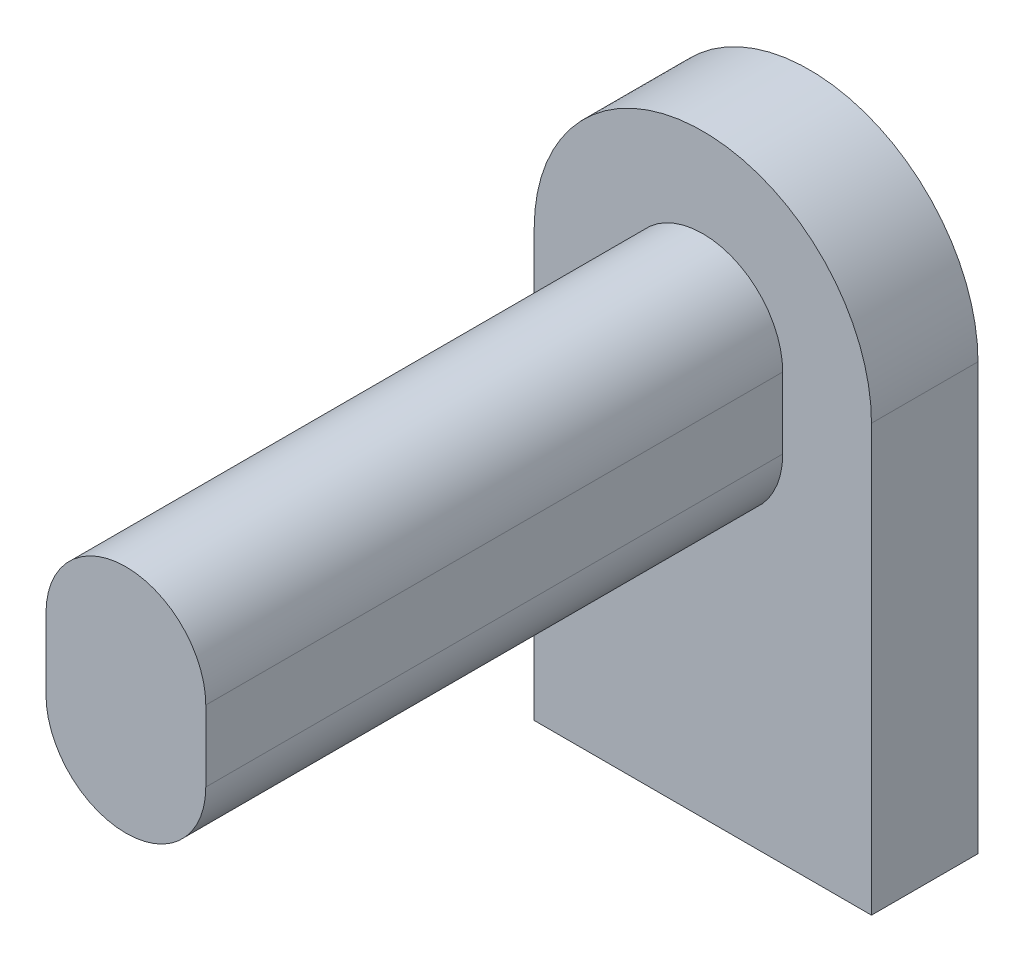
ISO-10303-21;
HEADER;
FILE_DESCRIPTION(('STEP AP214'),'2;1');
FILE_NAME('part.step','',(''),(''),'','','');
FILE_SCHEMA(('AUTOMOTIVE_DESIGN { 1 0 10303 214 1 1 1 1 }'));
ENDSEC;
DATA;
#1=APPLICATION_CONTEXT('core data for automotive mechanical design processes');
#2=APPLICATION_PROTOCOL_DEFINITION('international standard','automotive_design',2000,#1);
#3=PRODUCT_CONTEXT('',#1,'mechanical');
#4=PRODUCT('Part','Part','',(#3));
#5=PRODUCT_RELATED_PRODUCT_CATEGORY('part','',(#4));
#6=PRODUCT_DEFINITION_FORMATION('','',#4);
#7=PRODUCT_DEFINITION_CONTEXT('part definition',#1,'design');
#8=PRODUCT_DEFINITION('design','',#6,#7);
#9=PRODUCT_DEFINITION_SHAPE('','',#8);
#10=(LENGTH_UNIT() NAMED_UNIT(*) SI_UNIT(.MILLI.,.METRE.));
#11=(NAMED_UNIT(*) PLANE_ANGLE_UNIT() SI_UNIT($,.RADIAN.));
#12=(NAMED_UNIT(*) SI_UNIT($,.STERADIAN.) SOLID_ANGLE_UNIT());
#13=UNCERTAINTY_MEASURE_WITH_UNIT(LENGTH_MEASURE(1.E-05),#10,'distance_accuracy_value','');
#14=(GEOMETRIC_REPRESENTATION_CONTEXT(3) GLOBAL_UNCERTAINTY_ASSIGNED_CONTEXT((#13)) GLOBAL_UNIT_ASSIGNED_CONTEXT((#10,
#11,#12)) REPRESENTATION_CONTEXT('',''));
#15=CARTESIAN_POINT('',(0.,0.,0.));
#16=DIRECTION('',(0.,0.,1.));
#17=DIRECTION('',(1.,0.,0.));
#18=AXIS2_PLACEMENT_3D('',#15,#16,#17);
#19=CARTESIAN_POINT('',(-53.8351531475329,20.8584262703084,6.5));
#20=DIRECTION('',(0.,0.,-1.));
#21=DIRECTION('',(-1.,0.,0.));
#22=AXIS2_PLACEMENT_3D('',#19,#20,#21);
#23=CYLINDRICAL_SURFACE('',#22,0.900000000000001);
#24=CARTESIAN_POINT('',(-53.8351531475329,20.8584262703084,0.));
#25=DIRECTION('',(0.,0.,1.));
#26=DIRECTION('',(-1.,0.,0.));
#27=AXIS2_PLACEMENT_3D('',#24,#25,#26);
#28=CIRCLE('',#27,0.900000000000001);
#29=CARTESIAN_POINT('',(-52.9351531475329,20.8584262703084,0.));
#30=VERTEX_POINT('',#29);
#31=CARTESIAN_POINT('',(-54.7351531475329,20.8584262703084,0.));
#32=VERTEX_POINT('',#31);
#33=EDGE_CURVE('E103',#30,#32,#28,.T.);
#34=ORIENTED_EDGE('',*,*,#33,.T.);
#35=DIRECTION('',(0.,0.,-1.));
#36=VECTOR('',#35,1.);
#37=CARTESIAN_POINT('',(-54.7351531475329,20.8584262703084,6.5));
#38=LINE('',#37,#36);
#39=CARTESIAN_POINT('',(-54.7351531475329,20.8584262703084,6.5));
#40=VERTEX_POINT('',#39);
#41=EDGE_CURVE('E11',#40,#32,#38,.T.);
#42=ORIENTED_EDGE('',*,*,#41,.F.);
#43=CARTESIAN_POINT('',(-53.8351531475329,20.8584262703084,6.5));
#44=DIRECTION('',(0.,0.,1.));
#45=DIRECTION('',(-1.,0.,0.));
#46=AXIS2_PLACEMENT_3D('',#43,#44,#45);
#47=CIRCLE('',#46,0.900000000000001);
#48=CARTESIAN_POINT('',(-52.9351531475329,20.8584262703084,6.5));
#49=VERTEX_POINT('',#48);
#50=EDGE_CURVE('E135',#49,#40,#47,.T.);
#51=ORIENTED_EDGE('',*,*,#50,.F.);
#52=DIRECTION('',(0.,0.,-1.));
#53=VECTOR('',#52,1.);
#54=CARTESIAN_POINT('',(-52.9351531475329,20.8584262703084,6.5));
#55=LINE('',#54,#53);
#56=EDGE_CURVE('E143',#49,#30,#55,.T.);
#57=ORIENTED_EDGE('',*,*,#56,.T.);
#58=EDGE_LOOP('',(#34,#42,#51,#57));
#59=FACE_BOUND('',#58,.T.);
#60=ADVANCED_FACE('F33',(#59),#23,.T.);
#61=CARTESIAN_POINT('',(-54.7351531475329,20.8584262703084,6.5));
#62=DIRECTION('',(1.,0.,0.));
#63=DIRECTION('',(0.,0.,-1.));
#64=AXIS2_PLACEMENT_3D('',#61,#62,#63);
#65=PLANE('',#64);
#66=DIRECTION('',(0.,-1.,0.));
#67=VECTOR('',#66,1.);
#68=CARTESIAN_POINT('',(-54.7351531475329,20.8584262703084,0.));
#69=LINE('',#68,#67);
#70=CARTESIAN_POINT('',(-54.7351531475329,20.0584262703084,0.));
#71=VERTEX_POINT('',#70);
#72=EDGE_CURVE('E146',#32,#71,#69,.T.);
#73=ORIENTED_EDGE('',*,*,#72,.T.);
#74=DIRECTION('',(0.,0.,-1.));
#75=VECTOR('',#74,1.);
#76=CARTESIAN_POINT('',(-54.7351531475329,20.0584262703084,6.5));
#77=LINE('',#76,#75);
#78=CARTESIAN_POINT('',(-54.7351531475329,20.0584262703084,6.5));
#79=VERTEX_POINT('',#78);
#80=EDGE_CURVE('E41',#79,#71,#77,.T.);
#81=ORIENTED_EDGE('',*,*,#80,.F.);
#82=DIRECTION('',(0.,-1.,0.));
#83=VECTOR('',#82,1.);
#84=CARTESIAN_POINT('',(-54.7351531475329,20.8584262703084,6.5));
#85=LINE('',#84,#83);
#86=EDGE_CURVE('E137',#40,#79,#85,.T.);
#87=ORIENTED_EDGE('',*,*,#86,.F.);
#88=ORIENTED_EDGE('',*,*,#41,.T.);
#89=EDGE_LOOP('',(#73,#81,#87,#88));
#90=FACE_BOUND('',#89,.T.);
#91=ADVANCED_FACE('F166',(#90),#65,.F.);
#92=CARTESIAN_POINT('',(-53.8351531475329,20.0584262703084,6.5));
#93=DIRECTION('',(0.,0.,-1.));
#94=DIRECTION('',(-1.,0.,0.));
#95=AXIS2_PLACEMENT_3D('',#92,#93,#94);
#96=CYLINDRICAL_SURFACE('',#95,0.900000000000001);
#97=CARTESIAN_POINT('',(-53.8351531475329,20.0584262703084,0.));
#98=DIRECTION('',(0.,0.,1.));
#99=DIRECTION('',(-1.,0.,0.));
#100=AXIS2_PLACEMENT_3D('',#97,#98,#99);
#101=CIRCLE('',#100,0.900000000000001);
#102=CARTESIAN_POINT('',(-52.9351531475329,20.0584262703084,0.));
#103=VERTEX_POINT('',#102);
#104=EDGE_CURVE('E149',#71,#103,#101,.T.);
#105=ORIENTED_EDGE('',*,*,#104,.T.);
#106=DIRECTION('',(0.,0.,-1.));
#107=VECTOR('',#106,1.);
#108=CARTESIAN_POINT('',(-52.9351531475329,20.0584262703084,6.5));
#109=LINE('',#108,#107);
#110=CARTESIAN_POINT('',(-52.9351531475329,20.0584262703084,6.5));
#111=VERTEX_POINT('',#110);
#112=EDGE_CURVE('E156',#111,#103,#109,.T.);
#113=ORIENTED_EDGE('',*,*,#112,.F.);
#114=CARTESIAN_POINT('',(-53.8351531475329,20.0584262703084,6.5));
#115=DIRECTION('',(0.,0.,1.));
#116=DIRECTION('',(-1.,0.,0.));
#117=AXIS2_PLACEMENT_3D('',#114,#115,#116);
#118=CIRCLE('',#117,0.900000000000001);
#119=EDGE_CURVE('E140',#79,#111,#118,.T.);
#120=ORIENTED_EDGE('',*,*,#119,.F.);
#121=ORIENTED_EDGE('',*,*,#80,.T.);
#122=EDGE_LOOP('',(#105,#113,#120,#121));
#123=FACE_BOUND('',#122,.T.);
#124=ADVANCED_FACE('F162',(#123),#96,.T.);
#125=CARTESIAN_POINT('',(-52.9351531475329,20.8584262703084,6.5));
#126=DIRECTION('',(-1.,0.,0.));
#127=DIRECTION('',(0.,0.,1.));
#128=AXIS2_PLACEMENT_3D('',#125,#126,#127);
#129=PLANE('',#128);
#130=DIRECTION('',(0.,1.,0.));
#131=VECTOR('',#130,1.);
#132=CARTESIAN_POINT('',(-52.9351531475329,20.8584262703084,0.));
#133=LINE('',#132,#131);
#134=EDGE_CURVE('E138',#103,#30,#133,.T.);
#135=ORIENTED_EDGE('',*,*,#134,.T.);
#136=ORIENTED_EDGE('',*,*,#56,.F.);
#137=DIRECTION('',(0.,1.,0.));
#138=VECTOR('',#137,1.);
#139=CARTESIAN_POINT('',(-52.9351531475329,20.8584262703084,6.5));
#140=LINE('',#139,#138);
#141=EDGE_CURVE('E48',#111,#49,#140,.T.);
#142=ORIENTED_EDGE('',*,*,#141,.F.);
#143=ORIENTED_EDGE('',*,*,#112,.T.);
#144=EDGE_LOOP('',(#135,#136,#142,#143));
#145=FACE_BOUND('',#144,.T.);
#146=ADVANCED_FACE('F172',(#145),#129,.F.);
#147=CARTESIAN_POINT('',(-53.8351531475329,20.8584262703084,6.5));
#148=DIRECTION('',(0.,0.,-1.));
#149=DIRECTION('',(-1.,0.,0.));
#150=AXIS2_PLACEMENT_3D('',#147,#148,#149);
#151=PLANE('',#150);
#152=ORIENTED_EDGE('',*,*,#50,.T.);
#153=ORIENTED_EDGE('',*,*,#86,.T.);
#154=ORIENTED_EDGE('',*,*,#119,.T.);
#155=ORIENTED_EDGE('',*,*,#141,.T.);
#156=EDGE_LOOP('',(#152,#153,#154,#155));
#157=FACE_BOUND('',#156,.T.);
#158=ADVANCED_FACE('F175',(#157),#151,.F.);
#159=CARTESIAN_POINT('',(-55.7351531475329,1.61141797670313E-13,-1.2));
#160=DIRECTION('',(-1.,0.,0.));
#161=DIRECTION('',(0.,-1.,0.));
#162=AXIS2_PLACEMENT_3D('',#159,#160,#161);
#163=PLANE('',#162);
#164=DIRECTION('',(0.,-1.,0.));
#165=VECTOR('',#164,1.);
#166=CARTESIAN_POINT('',(-55.7351531475329,1.61141797670313E-13,0.));
#167=LINE('',#166,#165);
#168=CARTESIAN_POINT('',(-55.7351531475329,20.8584262703084,0.));
#169=VERTEX_POINT('',#168);
#170=CARTESIAN_POINT('',(-55.7351531475329,16.0584262703084,0.));
#171=VERTEX_POINT('',#170);
#172=EDGE_CURVE('E98',#169,#171,#167,.T.);
#173=ORIENTED_EDGE('',*,*,#172,.F.);
#174=DIRECTION('',(0.,0.,1.));
#175=VECTOR('',#174,1.);
#176=CARTESIAN_POINT('',(-55.7351531475329,20.8584262703084,-1.2));
#177=LINE('',#176,#175);
#178=CARTESIAN_POINT('',(-55.7351531475329,20.8584262703084,-1.2));
#179=VERTEX_POINT('',#178);
#180=EDGE_CURVE('E93',#179,#169,#177,.T.);
#181=ORIENTED_EDGE('',*,*,#180,.F.);
#182=DIRECTION('',(0.,-1.,0.));
#183=VECTOR('',#182,1.);
#184=CARTESIAN_POINT('',(-55.7351531475329,1.61141797670313E-13,-1.2));
#185=LINE('',#184,#183);
#186=CARTESIAN_POINT('',(-55.7351531475329,16.0584262703084,-1.2));
#187=VERTEX_POINT('',#186);
#188=EDGE_CURVE('E96',#179,#187,#185,.T.);
#189=ORIENTED_EDGE('',*,*,#188,.T.);
#190=DIRECTION('',(0.,0.,1.));
#191=VECTOR('',#190,1.);
#192=CARTESIAN_POINT('',(-55.7351531475329,16.0584262703084,-1.2));
#193=LINE('',#192,#191);
#194=EDGE_CURVE('E122',#187,#171,#193,.T.);
#195=ORIENTED_EDGE('',*,*,#194,.T.);
#196=EDGE_LOOP('',(#173,#181,#189,#195));
#197=FACE_BOUND('',#196,.T.);
#198=ADVANCED_FACE('F95',(#197),#163,.T.);
#199=CARTESIAN_POINT('',(-53.8351531475329,20.8584262703084,-1.2));
#200=DIRECTION('',(0.,0.,1.));
#201=DIRECTION('',(1.,0.,0.));
#202=AXIS2_PLACEMENT_3D('',#199,#200,#201);
#203=CYLINDRICAL_SURFACE('',#202,1.9);
#204=CARTESIAN_POINT('',(-53.8351531475329,20.8584262703084,0.));
#205=DIRECTION('',(0.,0.,-1.));
#206=DIRECTION('',(-1.,0.,0.));
#207=AXIS2_PLACEMENT_3D('',#204,#205,#206);
#208=CIRCLE('',#207,1.9);
#209=CARTESIAN_POINT('',(-51.9351531475329,20.8584262703084,0.));
#210=VERTEX_POINT('',#209);
#211=EDGE_CURVE('E124',#210,#169,#208,.F.);
#212=ORIENTED_EDGE('',*,*,#211,.F.);
#213=DIRECTION('',(0.,0.,1.));
#214=VECTOR('',#213,1.);
#215=CARTESIAN_POINT('',(-51.9351531475329,20.8584262703084,-1.2));
#216=LINE('',#215,#214);
#217=CARTESIAN_POINT('',(-51.9351531475329,20.8584262703084,-1.2));
#218=VERTEX_POINT('',#217);
#219=EDGE_CURVE('E104',#218,#210,#216,.T.);
#220=ORIENTED_EDGE('',*,*,#219,.F.);
#221=CARTESIAN_POINT('',(-53.8351531475329,20.8584262703084,-1.2));
#222=DIRECTION('',(0.,0.,-1.));
#223=DIRECTION('',(-1.,0.,0.));
#224=AXIS2_PLACEMENT_3D('',#221,#222,#223);
#225=CIRCLE('',#224,1.9);
#226=EDGE_CURVE('E109',#218,#179,#225,.F.);
#227=ORIENTED_EDGE('',*,*,#226,.T.);
#228=ORIENTED_EDGE('',*,*,#180,.T.);
#229=EDGE_LOOP('',(#212,#220,#227,#228));
#230=FACE_BOUND('',#229,.T.);
#231=ADVANCED_FACE('F115',(#230),#203,.T.);
#232=CARTESIAN_POINT('',(-51.9351531475329,1.50155215655794E-13,-1.2));
#233=DIRECTION('',(-1.,0.,0.));
#234=DIRECTION('',(0.,-1.,0.));
#235=AXIS2_PLACEMENT_3D('',#232,#233,#234);
#236=PLANE('',#235);
#237=DIRECTION('',(0.,-1.,0.));
#238=VECTOR('',#237,1.);
#239=CARTESIAN_POINT('',(-51.9351531475329,1.50155215655794E-13,0.));
#240=LINE('',#239,#238);
#241=CARTESIAN_POINT('',(-51.9351531475329,16.0584262703084,0.));
#242=VERTEX_POINT('',#241);
#243=EDGE_CURVE('E126',#210,#242,#240,.T.);
#244=ORIENTED_EDGE('',*,*,#243,.T.);
#245=DIRECTION('',(0.,0.,1.));
#246=VECTOR('',#245,1.);
#247=CARTESIAN_POINT('',(-51.9351531475329,16.0584262703084,-1.2));
#248=LINE('',#247,#246);
#249=CARTESIAN_POINT('',(-51.9351531475329,16.0584262703084,-1.2));
#250=VERTEX_POINT('',#249);
#251=EDGE_CURVE('E131',#250,#242,#248,.T.);
#252=ORIENTED_EDGE('',*,*,#251,.F.);
#253=DIRECTION('',(0.,-1.,0.));
#254=VECTOR('',#253,1.);
#255=CARTESIAN_POINT('',(-51.9351531475329,1.50155215655794E-13,-1.2));
#256=LINE('',#255,#254);
#257=EDGE_CURVE('E117',#218,#250,#256,.T.);
#258=ORIENTED_EDGE('',*,*,#257,.F.);
#259=ORIENTED_EDGE('',*,*,#219,.T.);
#260=EDGE_LOOP('',(#244,#252,#258,#259));
#261=FACE_BOUND('',#260,.T.);
#262=ADVANCED_FACE('F214',(#261),#236,.F.);
#263=CARTESIAN_POINT('',(0.,16.0584262703084,-1.2));
#264=DIRECTION('',(0.,1.,0.));
#265=DIRECTION('',(0.,0.,1.));
#266=AXIS2_PLACEMENT_3D('',#263,#264,#265);
#267=PLANE('',#266);
#268=DIRECTION('',(-1.,0.,0.));
#269=VECTOR('',#268,1.);
#270=CARTESIAN_POINT('',(0.,16.0584262703084,0.));
#271=LINE('',#270,#269);
#272=EDGE_CURVE('E113',#242,#171,#271,.T.);
#273=ORIENTED_EDGE('',*,*,#272,.T.);
#274=ORIENTED_EDGE('',*,*,#194,.F.);
#275=DIRECTION('',(-1.,0.,0.));
#276=VECTOR('',#275,1.);
#277=CARTESIAN_POINT('',(0.,16.0584262703084,-1.2));
#278=LINE('',#277,#276);
#279=EDGE_CURVE('E111',#250,#187,#278,.T.);
#280=ORIENTED_EDGE('',*,*,#279,.F.);
#281=ORIENTED_EDGE('',*,*,#251,.T.);
#282=EDGE_LOOP('',(#273,#274,#280,#281));
#283=FACE_BOUND('',#282,.T.);
#284=ADVANCED_FACE('F223',(#283),#267,.F.);
#285=CARTESIAN_POINT('',(0.,0.,-1.2));
#286=DIRECTION('',(0.,0.,-1.));
#287=DIRECTION('',(-1.,0.,0.));
#288=AXIS2_PLACEMENT_3D('',#285,#286,#287);
#289=PLANE('',#288);
#290=ORIENTED_EDGE('',*,*,#188,.F.);
#291=ORIENTED_EDGE('',*,*,#226,.F.);
#292=ORIENTED_EDGE('',*,*,#257,.T.);
#293=ORIENTED_EDGE('',*,*,#279,.T.);
#294=EDGE_LOOP('',(#290,#291,#292,#293));
#295=FACE_BOUND('',#294,.T.);
#296=ADVANCED_FACE('F108',(#295),#289,.T.);
#297=CARTESIAN_POINT('',(0.,0.,0.));
#298=DIRECTION('',(0.,0.,-1.));
#299=DIRECTION('',(-1.,0.,0.));
#300=AXIS2_PLACEMENT_3D('',#297,#298,#299);
#301=PLANE('',#300);
#302=ORIENTED_EDGE('',*,*,#33,.F.);
#303=ORIENTED_EDGE('',*,*,#134,.F.);
#304=ORIENTED_EDGE('',*,*,#104,.F.);
#305=ORIENTED_EDGE('',*,*,#72,.F.);
#306=EDGE_LOOP('',(#302,#303,#304,#305));
#307=FACE_BOUND('',#306,.T.);
#308=ORIENTED_EDGE('',*,*,#172,.T.);
#309=ORIENTED_EDGE('',*,*,#272,.F.);
#310=ORIENTED_EDGE('',*,*,#243,.F.);
#311=ORIENTED_EDGE('',*,*,#211,.T.);
#312=EDGE_LOOP('',(#308,#309,#310,#311));
#313=FACE_BOUND('',#312,.T.);
#314=ADVANCED_FACE('F169',(#307,#313),#301,.F.);
#315=CLOSED_SHELL('',(#60,#91,#124,#146,#158,#198,#231,#262,#284,#296,#314));
#316=MANIFOLD_SOLID_BREP('B2',#315);
#317=ADVANCED_BREP_SHAPE_REPRESENTATION('',(#18,#316),#14);
#318=SHAPE_DEFINITION_REPRESENTATION(#9,#317);
ENDSEC;
END-ISO-10303-21;
